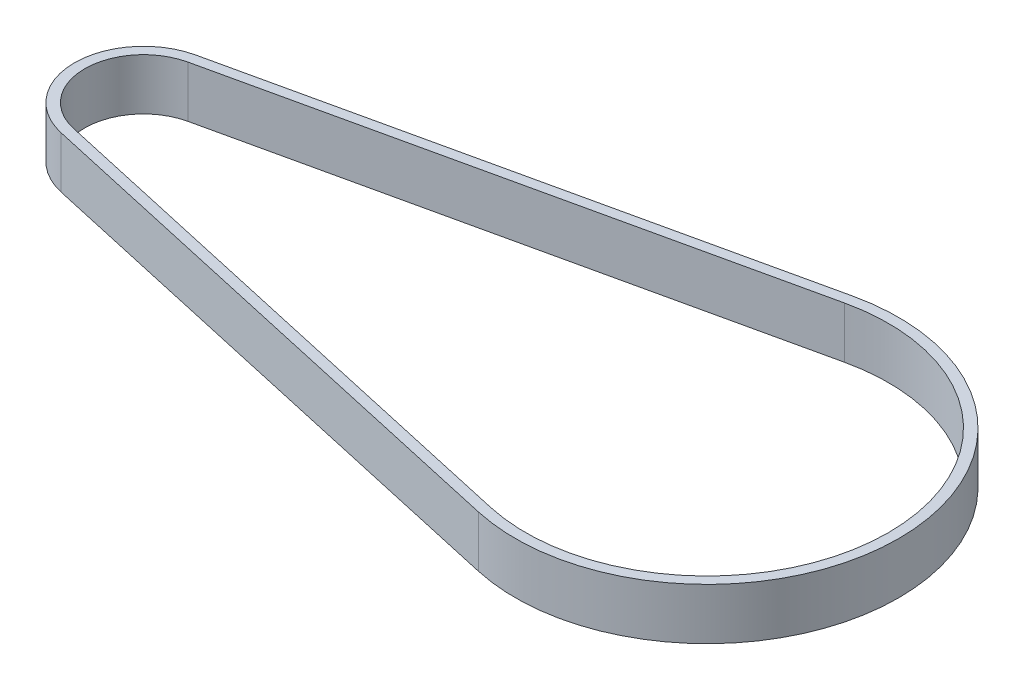
ISO-10303-21;
HEADER;
FILE_DESCRIPTION(('STEP AP214'),'2;1');
FILE_NAME('part.step','',(''),(''),'','','');
FILE_SCHEMA(('AUTOMOTIVE_DESIGN { 1 0 10303 214 1 1 1 1 }'));
ENDSEC;
DATA;
#1=APPLICATION_CONTEXT('core data for automotive mechanical design processes');
#2=APPLICATION_PROTOCOL_DEFINITION('international standard','automotive_design',2000,#1);
#3=PRODUCT_CONTEXT('',#1,'mechanical');
#4=PRODUCT('Part','Part','',(#3));
#5=PRODUCT_RELATED_PRODUCT_CATEGORY('part','',(#4));
#6=PRODUCT_DEFINITION_FORMATION('','',#4);
#7=PRODUCT_DEFINITION_CONTEXT('part definition',#1,'design');
#8=PRODUCT_DEFINITION('design','',#6,#7);
#9=PRODUCT_DEFINITION_SHAPE('','',#8);
#10=(LENGTH_UNIT() NAMED_UNIT(*) SI_UNIT(.MILLI.,.METRE.));
#11=(NAMED_UNIT(*) PLANE_ANGLE_UNIT() SI_UNIT($,.RADIAN.));
#12=(NAMED_UNIT(*) SI_UNIT($,.STERADIAN.) SOLID_ANGLE_UNIT());
#13=UNCERTAINTY_MEASURE_WITH_UNIT(LENGTH_MEASURE(1.E-05),#10,'distance_accuracy_value','');
#14=(GEOMETRIC_REPRESENTATION_CONTEXT(3) GLOBAL_UNCERTAINTY_ASSIGNED_CONTEXT((#13)) GLOBAL_UNIT_ASSIGNED_CONTEXT((#10,
#11,#12)) REPRESENTATION_CONTEXT('',''));
#15=CARTESIAN_POINT('',(0.,0.,0.));
#16=DIRECTION('',(0.,0.,1.));
#17=DIRECTION('',(1.,0.,0.));
#18=AXIS2_PLACEMENT_3D('',#15,#16,#17);
#19=CARTESIAN_POINT('',(0.,-2.,0.));
#20=DIRECTION('',(0.,1.,0.));
#21=DIRECTION('',(0.,0.,1.));
#22=AXIS2_PLACEMENT_3D('',#19,#20,#21);
#23=CYLINDRICAL_SURFACE('',#22,5.375);
#24=DIRECTION('',(0.,1.,0.));
#25=VECTOR('',#24,1.);
#26=CARTESIAN_POINT('',(-1.16927676537585,-2.,5.24627647441042));
#27=LINE('',#26,#25);
#28=CARTESIAN_POINT('',(-1.16927676537585,-2.,5.24627647441042));
#29=VERTEX_POINT('',#28);
#30=CARTESIAN_POINT('',(-1.16927676537585,2.,5.24627647441042));
#31=VERTEX_POINT('',#30);
#32=EDGE_CURVE('E90',#29,#31,#27,.T.);
#33=ORIENTED_EDGE('',*,*,#32,.T.);
#34=CARTESIAN_POINT('',(0.,2.,0.));
#35=DIRECTION('',(0.,1.,0.));
#36=DIRECTION('',(1.,0.,0.));
#37=AXIS2_PLACEMENT_3D('',#34,#35,#36);
#38=CIRCLE('',#37,5.375);
#39=CARTESIAN_POINT('',(-1.16927676537585,2.,-5.24627647441042));
#40=VERTEX_POINT('',#39);
#41=EDGE_CURVE('E182',#40,#31,#38,.T.);
#42=ORIENTED_EDGE('',*,*,#41,.F.);
#43=DIRECTION('',(0.,1.,0.));
#44=VECTOR('',#43,1.);
#45=CARTESIAN_POINT('',(-1.16927676537585,-2.,-5.24627647441042));
#46=LINE('',#45,#44);
#47=CARTESIAN_POINT('',(-1.16927676537585,-2.,-5.24627647441042));
#48=VERTEX_POINT('',#47);
#49=EDGE_CURVE('E12',#48,#40,#46,.T.);
#50=ORIENTED_EDGE('',*,*,#49,.F.);
#51=CARTESIAN_POINT('',(0.,-2.,0.));
#52=DIRECTION('',(0.,1.,0.));
#53=DIRECTION('',(1.,0.,0.));
#54=AXIS2_PLACEMENT_3D('',#51,#52,#53);
#55=CIRCLE('',#54,5.375);
#56=EDGE_CURVE('E201',#48,#29,#55,.T.);
#57=ORIENTED_EDGE('',*,*,#56,.T.);
#58=EDGE_LOOP('',(#33,#42,#50,#57));
#59=FACE_BOUND('',#58,.T.);
#60=ADVANCED_FACE('F87',(#59),#23,.T.);
#61=CARTESIAN_POINT('',(-1.16927676537585,-2.,-5.24627647441042));
#62=DIRECTION('',(-0.21753986332574,0.,-0.976051437099612));
#63=DIRECTION('',(-0.976051437099612,0.,0.21753986332574));
#64=AXIS2_PLACEMENT_3D('',#61,#62,#63);
#65=PLANE('',#64);
#66=ORIENTED_EDGE('',*,*,#49,.T.);
#67=DIRECTION('',(-0.976051437099612,0.,0.21753986332574));
#68=VECTOR('',#67,1.);
#69=CARTESIAN_POINT('',(-1.16927676537585,2.,-5.24627647441042));
#70=LINE('',#69,#68);
#71=CARTESIAN_POINT('',(40.6532175398633,2.,-14.5675676987117));
#72=VERTEX_POINT('',#71);
#73=EDGE_CURVE('E191',#72,#40,#70,.T.);
#74=ORIENTED_EDGE('',*,*,#73,.F.);
#75=DIRECTION('',(0.,1.,0.));
#76=VECTOR('',#75,1.);
#77=CARTESIAN_POINT('',(40.6532175398633,-2.,-14.5675676987117));
#78=LINE('',#77,#76);
#79=CARTESIAN_POINT('',(40.6532175398633,-2.,-14.5675676987117));
#80=VERTEX_POINT('',#79);
#81=EDGE_CURVE('E95',#80,#72,#78,.T.);
#82=ORIENTED_EDGE('',*,*,#81,.F.);
#83=DIRECTION('',(-0.976051437099612,0.,0.21753986332574));
#84=VECTOR('',#83,1.);
#85=CARTESIAN_POINT('',(-1.16927676537585,-2.,-5.24627647441042));
#86=LINE('',#85,#84);
#87=EDGE_CURVE('E212',#80,#48,#86,.T.);
#88=ORIENTED_EDGE('',*,*,#87,.T.);
#89=EDGE_LOOP('',(#66,#74,#82,#88));
#90=FACE_BOUND('',#89,.T.);
#91=ADVANCED_FACE('F224',(#90),#65,.T.);
#92=CARTESIAN_POINT('',(43.9,-2.,0.));
#93=DIRECTION('',(0.,1.,0.));
#94=DIRECTION('',(0.,0.,1.));
#95=AXIS2_PLACEMENT_3D('',#92,#93,#94);
#96=CYLINDRICAL_SURFACE('',#95,14.925);
#97=ORIENTED_EDGE('',*,*,#81,.T.);
#98=CARTESIAN_POINT('',(43.9,2.,0.));
#99=DIRECTION('',(0.,1.,0.));
#100=DIRECTION('',(1.,0.,0.));
#101=AXIS2_PLACEMENT_3D('',#98,#99,#100);
#102=CIRCLE('',#101,14.925);
#103=CARTESIAN_POINT('',(40.6532175398633,2.,14.5675676987117));
#104=VERTEX_POINT('',#103);
#105=EDGE_CURVE('E188',#104,#72,#102,.T.);
#106=ORIENTED_EDGE('',*,*,#105,.F.);
#107=DIRECTION('',(0.,1.,0.));
#108=VECTOR('',#107,1.);
#109=CARTESIAN_POINT('',(40.6532175398633,-2.,14.5675676987117));
#110=LINE('',#109,#108);
#111=CARTESIAN_POINT('',(40.6532175398633,-2.,14.5675676987117));
#112=VERTEX_POINT('',#111);
#113=EDGE_CURVE('E215',#112,#104,#110,.T.);
#114=ORIENTED_EDGE('',*,*,#113,.F.);
#115=CARTESIAN_POINT('',(43.9,-2.,0.));
#116=DIRECTION('',(0.,1.,0.));
#117=DIRECTION('',(1.,0.,0.));
#118=AXIS2_PLACEMENT_3D('',#115,#116,#117);
#119=CIRCLE('',#118,14.925);
#120=EDGE_CURVE('E209',#112,#80,#119,.T.);
#121=ORIENTED_EDGE('',*,*,#120,.T.);
#122=EDGE_LOOP('',(#97,#106,#114,#121));
#123=FACE_BOUND('',#122,.T.);
#124=ADVANCED_FACE('F230',(#123),#96,.T.);
#125=CARTESIAN_POINT('',(-1.16927676537585,-2.,5.24627647441042));
#126=DIRECTION('',(-0.21753986332574,0.,0.976051437099612));
#127=DIRECTION('',(0.976051437099612,0.,0.21753986332574));
#128=AXIS2_PLACEMENT_3D('',#125,#126,#127);
#129=PLANE('',#128);
#130=ORIENTED_EDGE('',*,*,#113,.T.);
#131=DIRECTION('',(0.976051437099612,0.,0.21753986332574));
#132=VECTOR('',#131,1.);
#133=CARTESIAN_POINT('',(-1.16927676537585,2.,5.24627647441042));
#134=LINE('',#133,#132);
#135=EDGE_CURVE('E185',#31,#104,#134,.T.);
#136=ORIENTED_EDGE('',*,*,#135,.F.);
#137=ORIENTED_EDGE('',*,*,#32,.F.);
#138=DIRECTION('',(0.976051437099612,0.,0.21753986332574));
#139=VECTOR('',#138,1.);
#140=CARTESIAN_POINT('',(-1.16927676537585,-2.,5.24627647441042));
#141=LINE('',#140,#139);
#142=EDGE_CURVE('E206',#29,#112,#141,.T.);
#143=ORIENTED_EDGE('',*,*,#142,.T.);
#144=EDGE_LOOP('',(#130,#136,#137,#143));
#145=FACE_BOUND('',#144,.T.);
#146=ADVANCED_FACE('F219',(#145),#129,.T.);
#147=CARTESIAN_POINT('',(0.,-2.,0.));
#148=DIRECTION('',(0.,1.,0.));
#149=DIRECTION('',(0.,0.,1.));
#150=AXIS2_PLACEMENT_3D('',#147,#148,#149);
#151=PLANE('',#150);
#152=DIRECTION('',(-0.976051437099612,0.,0.21753986332574));
#153=VECTOR('',#152,1.);
#154=CARTESIAN_POINT('',(-0.995244874715262,-2.,-4.46543532473073));
#155=LINE('',#154,#153);
#156=CARTESIAN_POINT('',(40.8272494305239,-2.,-13.786726549032));
#157=VERTEX_POINT('',#156);
#158=CARTESIAN_POINT('',(-0.995244874715262,-2.,-4.46543532473073));
#159=VERTEX_POINT('',#158);
#160=EDGE_CURVE('E164',#157,#159,#155,.T.);
#161=ORIENTED_EDGE('',*,*,#160,.T.);
#162=CARTESIAN_POINT('',(0.,-2.,0.));
#163=DIRECTION('',(0.,1.,0.));
#164=DIRECTION('',(1.,0.,0.));
#165=AXIS2_PLACEMENT_3D('',#162,#163,#164);
#166=CIRCLE('',#165,4.575);
#167=CARTESIAN_POINT('',(-0.995244874715262,-2.,4.46543532473073));
#168=VERTEX_POINT('',#167);
#169=EDGE_CURVE('E194',#159,#168,#166,.T.);
#170=ORIENTED_EDGE('',*,*,#169,.T.);
#171=DIRECTION('',(0.976051437099612,0.,0.21753986332574));
#172=VECTOR('',#171,1.);
#173=CARTESIAN_POINT('',(-0.995244874715262,-2.,4.46543532473073));
#174=LINE('',#173,#172);
#175=CARTESIAN_POINT('',(40.8272494305239,-2.,13.786726549032));
#176=VERTEX_POINT('',#175);
#177=EDGE_CURVE('E159',#168,#176,#174,.T.);
#178=ORIENTED_EDGE('',*,*,#177,.T.);
#179=CARTESIAN_POINT('',(43.9,-2.,0.));
#180=DIRECTION('',(0.,1.,0.));
#181=DIRECTION('',(1.,0.,0.));
#182=AXIS2_PLACEMENT_3D('',#179,#180,#181);
#183=CIRCLE('',#182,14.125);
#184=EDGE_CURVE('E103',#176,#157,#183,.T.);
#185=ORIENTED_EDGE('',*,*,#184,.T.);
#186=EDGE_LOOP('',(#161,#170,#178,#185));
#187=FACE_BOUND('',#186,.T.);
#188=ORIENTED_EDGE('',*,*,#56,.F.);
#189=ORIENTED_EDGE('',*,*,#87,.F.);
#190=ORIENTED_EDGE('',*,*,#120,.F.);
#191=ORIENTED_EDGE('',*,*,#142,.F.);
#192=EDGE_LOOP('',(#188,#189,#190,#191));
#193=FACE_BOUND('',#192,.T.);
#194=ADVANCED_FACE('F228',(#187,#193),#151,.F.);
#195=CARTESIAN_POINT('',(0.,-2.,0.));
#196=DIRECTION('',(0.,1.,0.));
#197=DIRECTION('',(0.,0.,1.));
#198=AXIS2_PLACEMENT_3D('',#195,#196,#197);
#199=CYLINDRICAL_SURFACE('',#198,4.575);
#200=DIRECTION('',(0.,1.,0.));
#201=VECTOR('',#200,1.);
#202=CARTESIAN_POINT('',(-0.995244874715262,-2.,-4.46543532473073));
#203=LINE('',#202,#201);
#204=CARTESIAN_POINT('',(-0.995244874715262,2.,-4.46543532473073));
#205=VERTEX_POINT('',#204);
#206=EDGE_CURVE('E169',#159,#205,#203,.T.);
#207=ORIENTED_EDGE('',*,*,#206,.T.);
#208=CARTESIAN_POINT('',(0.,2.,0.));
#209=DIRECTION('',(0.,1.,0.));
#210=DIRECTION('',(1.,0.,0.));
#211=AXIS2_PLACEMENT_3D('',#208,#209,#210);
#212=CIRCLE('',#211,4.575);
#213=CARTESIAN_POINT('',(-0.995244874715262,2.,4.46543532473073));
#214=VERTEX_POINT('',#213);
#215=EDGE_CURVE('E167',#205,#214,#212,.T.);
#216=ORIENTED_EDGE('',*,*,#215,.T.);
#217=DIRECTION('',(0.,1.,0.));
#218=VECTOR('',#217,1.);
#219=CARTESIAN_POINT('',(-0.995244874715262,-2.,4.46543532473073));
#220=LINE('',#219,#218);
#221=EDGE_CURVE('E152',#168,#214,#220,.T.);
#222=ORIENTED_EDGE('',*,*,#221,.F.);
#223=ORIENTED_EDGE('',*,*,#169,.F.);
#224=EDGE_LOOP('',(#207,#216,#222,#223));
#225=FACE_BOUND('',#224,.T.);
#226=ADVANCED_FACE('F168',(#225),#199,.F.);
#227=CARTESIAN_POINT('',(-0.995244874715262,-2.,-4.46543532473073));
#228=DIRECTION('',(-0.21753986332574,0.,-0.976051437099612));
#229=DIRECTION('',(-0.976051437099612,0.,0.21753986332574));
#230=AXIS2_PLACEMENT_3D('',#227,#228,#229);
#231=PLANE('',#230);
#232=DIRECTION('',(0.,1.,0.));
#233=VECTOR('',#232,1.);
#234=CARTESIAN_POINT('',(40.8272494305239,-2.,-13.786726549032));
#235=LINE('',#234,#233);
#236=CARTESIAN_POINT('',(40.8272494305239,2.,-13.786726549032));
#237=VERTEX_POINT('',#236);
#238=EDGE_CURVE('E202',#157,#237,#235,.T.);
#239=ORIENTED_EDGE('',*,*,#238,.T.);
#240=DIRECTION('',(-0.976051437099612,0.,0.21753986332574));
#241=VECTOR('',#240,1.);
#242=CARTESIAN_POINT('',(-0.995244874715262,2.,-4.46543532473073));
#243=LINE('',#242,#241);
#244=EDGE_CURVE('E178',#237,#205,#243,.T.);
#245=ORIENTED_EDGE('',*,*,#244,.T.);
#246=ORIENTED_EDGE('',*,*,#206,.F.);
#247=ORIENTED_EDGE('',*,*,#160,.F.);
#248=EDGE_LOOP('',(#239,#245,#246,#247));
#249=FACE_BOUND('',#248,.T.);
#250=ADVANCED_FACE('F277',(#249),#231,.F.);
#251=CARTESIAN_POINT('',(43.9,-2.,0.));
#252=DIRECTION('',(0.,1.,0.));
#253=DIRECTION('',(0.,0.,1.));
#254=AXIS2_PLACEMENT_3D('',#251,#252,#253);
#255=CYLINDRICAL_SURFACE('',#254,14.125);
#256=DIRECTION('',(0.,1.,0.));
#257=VECTOR('',#256,1.);
#258=CARTESIAN_POINT('',(40.8272494305239,-2.,13.786726549032));
#259=LINE('',#258,#257);
#260=CARTESIAN_POINT('',(40.8272494305239,2.,13.786726549032));
#261=VERTEX_POINT('',#260);
#262=EDGE_CURVE('E163',#176,#261,#259,.T.);
#263=ORIENTED_EDGE('',*,*,#262,.T.);
#264=CARTESIAN_POINT('',(43.9,2.,0.));
#265=DIRECTION('',(0.,1.,0.));
#266=DIRECTION('',(1.,0.,0.));
#267=AXIS2_PLACEMENT_3D('',#264,#265,#266);
#268=CIRCLE('',#267,14.125);
#269=EDGE_CURVE('E176',#261,#237,#268,.T.);
#270=ORIENTED_EDGE('',*,*,#269,.T.);
#271=ORIENTED_EDGE('',*,*,#238,.F.);
#272=ORIENTED_EDGE('',*,*,#184,.F.);
#273=EDGE_LOOP('',(#263,#270,#271,#272));
#274=FACE_BOUND('',#273,.T.);
#275=ADVANCED_FACE('F287',(#274),#255,.F.);
#276=CARTESIAN_POINT('',(-0.995244874715262,-2.,4.46543532473073));
#277=DIRECTION('',(-0.21753986332574,0.,0.976051437099612));
#278=DIRECTION('',(0.976051437099612,0.,0.21753986332574));
#279=AXIS2_PLACEMENT_3D('',#276,#277,#278);
#280=PLANE('',#279);
#281=ORIENTED_EDGE('',*,*,#221,.T.);
#282=DIRECTION('',(0.976051437099612,0.,0.21753986332574));
#283=VECTOR('',#282,1.);
#284=CARTESIAN_POINT('',(-0.995244874715262,2.,4.46543532473073));
#285=LINE('',#284,#283);
#286=EDGE_CURVE('E156',#214,#261,#285,.T.);
#287=ORIENTED_EDGE('',*,*,#286,.T.);
#288=ORIENTED_EDGE('',*,*,#262,.F.);
#289=ORIENTED_EDGE('',*,*,#177,.F.);
#290=EDGE_LOOP('',(#281,#287,#288,#289));
#291=FACE_BOUND('',#290,.T.);
#292=ADVANCED_FACE('F154',(#291),#280,.F.);
#293=CARTESIAN_POINT('',(0.,2.,0.));
#294=DIRECTION('',(0.,1.,0.));
#295=DIRECTION('',(0.,0.,1.));
#296=AXIS2_PLACEMENT_3D('',#293,#294,#295);
#297=PLANE('',#296);
#298=ORIENTED_EDGE('',*,*,#41,.T.);
#299=ORIENTED_EDGE('',*,*,#135,.T.);
#300=ORIENTED_EDGE('',*,*,#105,.T.);
#301=ORIENTED_EDGE('',*,*,#73,.T.);
#302=EDGE_LOOP('',(#298,#299,#300,#301));
#303=FACE_BOUND('',#302,.T.);
#304=ORIENTED_EDGE('',*,*,#286,.F.);
#305=ORIENTED_EDGE('',*,*,#215,.F.);
#306=ORIENTED_EDGE('',*,*,#244,.F.);
#307=ORIENTED_EDGE('',*,*,#269,.F.);
#308=EDGE_LOOP('',(#304,#305,#306,#307));
#309=FACE_BOUND('',#308,.T.);
#310=ADVANCED_FACE('F174',(#303,#309),#297,.T.);
#311=CLOSED_SHELL('',(#60,#91,#124,#146,#194,#226,#250,#275,#292,#310));
#312=MANIFOLD_SOLID_BREP('B2',#311);
#313=ADVANCED_BREP_SHAPE_REPRESENTATION('',(#18,#312),#14);
#314=SHAPE_DEFINITION_REPRESENTATION(#9,#313);
ENDSEC;
END-ISO-10303-21;
